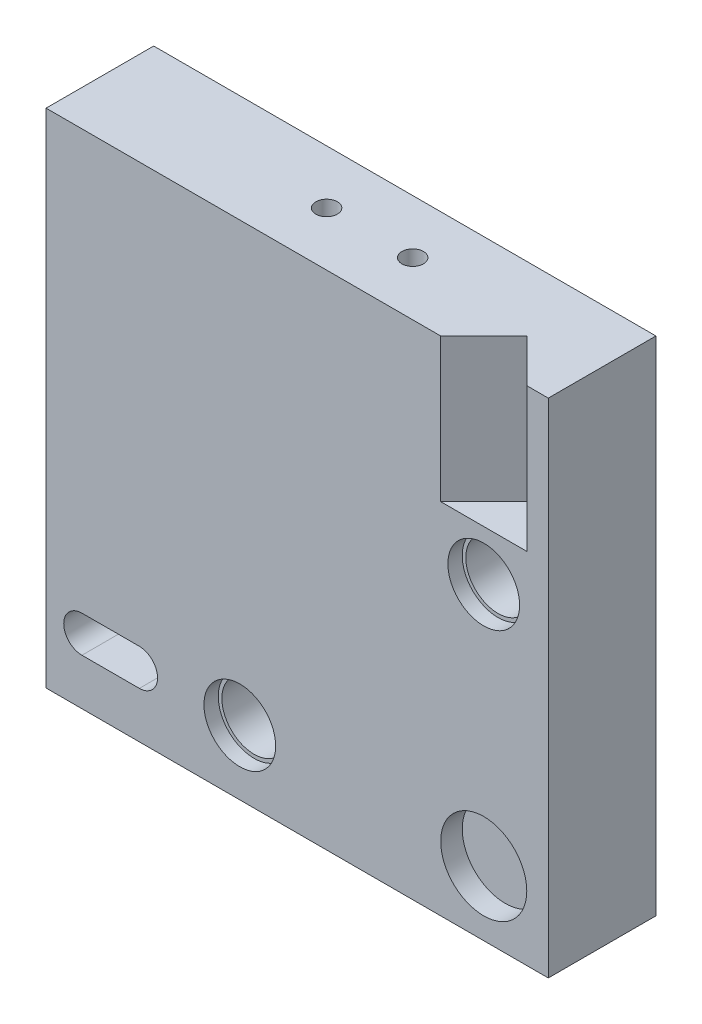
ISO-10303-21;
HEADER;
FILE_DESCRIPTION(('STEP AP214'),'2;1');
FILE_NAME('part.step','',(''),(''),'','','');
FILE_SCHEMA(('AUTOMOTIVE_DESIGN { 1 0 10303 214 1 1 1 1 }'));
ENDSEC;
DATA;
#1=APPLICATION_CONTEXT('core data for automotive mechanical design processes');
#2=APPLICATION_PROTOCOL_DEFINITION('international standard','automotive_design',2000,#1);
#3=PRODUCT_CONTEXT('',#1,'mechanical');
#4=PRODUCT('Part','Part','',(#3));
#5=PRODUCT_RELATED_PRODUCT_CATEGORY('part','',(#4));
#6=PRODUCT_DEFINITION_FORMATION('','',#4);
#7=PRODUCT_DEFINITION_CONTEXT('part definition',#1,'design');
#8=PRODUCT_DEFINITION('design','',#6,#7);
#9=PRODUCT_DEFINITION_SHAPE('','',#8);
#10=(LENGTH_UNIT() NAMED_UNIT(*) SI_UNIT(.MILLI.,.METRE.));
#11=(NAMED_UNIT(*) PLANE_ANGLE_UNIT() SI_UNIT($,.RADIAN.));
#12=(NAMED_UNIT(*) SI_UNIT($,.STERADIAN.) SOLID_ANGLE_UNIT());
#13=UNCERTAINTY_MEASURE_WITH_UNIT(LENGTH_MEASURE(1.E-05),#10,'distance_accuracy_value','');
#14=(GEOMETRIC_REPRESENTATION_CONTEXT(3) GLOBAL_UNCERTAINTY_ASSIGNED_CONTEXT((#13)) GLOBAL_UNIT_ASSIGNED_CONTEXT((#10,
#11,#12)) REPRESENTATION_CONTEXT('',''));
#15=CARTESIAN_POINT('',(0.,0.,0.));
#16=DIRECTION('',(0.,0.,1.));
#17=DIRECTION('',(1.,0.,0.));
#18=AXIS2_PLACEMENT_3D('',#15,#16,#17);
#19=CARTESIAN_POINT('',(-17.7337400728311,13.9900899837107,7.5));
#20=DIRECTION('',(1.,0.,0.));
#21=DIRECTION('',(0.,1.,0.));
#22=AXIS2_PLACEMENT_3D('',#19,#20,#21);
#23=PLANE('',#22);
#24=DIRECTION('',(0.,1.,0.));
#25=VECTOR('',#24,1.);
#26=CARTESIAN_POINT('',(-17.7337400728311,2.99008998371074,5.));
#27=LINE('',#26,#25);
#28=CARTESIAN_POINT('',(-17.7337400728311,-10.0099100162893,5.));
#29=VERTEX_POINT('',#28);
#30=CARTESIAN_POINT('',(-17.7337400728311,2.99008998371074,5.));
#31=VERTEX_POINT('',#30);
#32=EDGE_CURVE('E237',#29,#31,#27,.T.);
#33=ORIENTED_EDGE('',*,*,#32,.F.);
#34=DIRECTION('',(0.,0.,-1.));
#35=VECTOR('',#34,1.);
#36=CARTESIAN_POINT('',(-17.7337400728311,-10.0099100162893,5.));
#37=LINE('',#36,#35);
#38=CARTESIAN_POINT('',(-17.7337400728311,-10.0099100162893,0.));
#39=VERTEX_POINT('',#38);
#40=EDGE_CURVE('E257',#29,#39,#37,.T.);
#41=ORIENTED_EDGE('',*,*,#40,.T.);
#42=DIRECTION('',(0.,-1.,0.));
#43=VECTOR('',#42,1.);
#44=CARTESIAN_POINT('',(-17.7337400728311,13.9900899837107,0.));
#45=LINE('',#44,#43);
#46=CARTESIAN_POINT('',(-17.7337400728311,-21.0099100162893,0.));
#47=VERTEX_POINT('',#46);
#48=EDGE_CURVE('E260',#39,#47,#45,.T.);
#49=ORIENTED_EDGE('',*,*,#48,.T.);
#50=DIRECTION('',(0.,0.,-1.));
#51=VECTOR('',#50,1.);
#52=CARTESIAN_POINT('',(-17.7337400728311,-21.0099100162893,7.5));
#53=LINE('',#52,#51);
#54=CARTESIAN_POINT('',(-17.7337400728311,-21.0099100162893,7.5));
#55=VERTEX_POINT('',#54);
#56=EDGE_CURVE('E11',#55,#47,#53,.T.);
#57=ORIENTED_EDGE('',*,*,#56,.F.);
#58=DIRECTION('',(0.,-1.,0.));
#59=VECTOR('',#58,1.);
#60=CARTESIAN_POINT('',(-17.7337400728311,13.9900899837107,7.5));
#61=LINE('',#60,#59);
#62=CARTESIAN_POINT('',(-17.7337400728311,13.9900899837107,7.5));
#63=VERTEX_POINT('',#62);
#64=EDGE_CURVE('E266',#63,#55,#61,.T.);
#65=ORIENTED_EDGE('',*,*,#64,.F.);
#66=DIRECTION('',(0.,0.,-1.));
#67=VECTOR('',#66,1.);
#68=CARTESIAN_POINT('',(-17.7337400728311,13.9900899837107,7.5));
#69=LINE('',#68,#67);
#70=CARTESIAN_POINT('',(-17.7337400728311,13.9900899837107,0.));
#71=VERTEX_POINT('',#70);
#72=EDGE_CURVE('E278',#63,#71,#69,.T.);
#73=ORIENTED_EDGE('',*,*,#72,.T.);
#74=CARTESIAN_POINT('',(-17.7337400728311,2.99008998371073,0.));
#75=VERTEX_POINT('',#74);
#76=EDGE_CURVE('E279',#71,#75,#45,.T.);
#77=ORIENTED_EDGE('',*,*,#76,.T.);
#78=DIRECTION('',(0.,0.,-1.));
#79=VECTOR('',#78,1.);
#80=CARTESIAN_POINT('',(-17.7337400728311,2.99008998371074,5.));
#81=LINE('',#80,#79);
#82=EDGE_CURVE('E250',#31,#75,#81,.T.);
#83=ORIENTED_EDGE('',*,*,#82,.F.);
#84=EDGE_LOOP('',(#33,#41,#49,#57,#65,#73,#77,#83));
#85=FACE_BOUND('',#84,.T.);
#86=ADVANCED_FACE('F33',(#85),#23,.F.);
#87=CARTESIAN_POINT('',(-17.7337400728311,-21.0099100162893,7.5));
#88=DIRECTION('',(0.,1.,0.));
#89=DIRECTION('',(0.,0.,1.));
#90=AXIS2_PLACEMENT_3D('',#87,#88,#89);
#91=PLANE('',#90);
#92=DIRECTION('',(0.,0.,-1.));
#93=VECTOR('',#92,1.);
#94=CARTESIAN_POINT('',(17.2662599271689,-21.0099100162893,7.5));
#95=LINE('',#94,#93);
#96=CARTESIAN_POINT('',(17.2662599271689,-21.0099100162893,7.5));
#97=VERTEX_POINT('',#96);
#98=CARTESIAN_POINT('',(17.2662599271689,-21.0099100162893,0.));
#99=VERTEX_POINT('',#98);
#100=EDGE_CURVE('E40',#97,#99,#95,.T.);
#101=ORIENTED_EDGE('',*,*,#100,.F.);
#102=DIRECTION('',(1.,0.,0.));
#103=VECTOR('',#102,1.);
#104=CARTESIAN_POINT('',(-17.7337400728311,-21.0099100162893,7.5));
#105=LINE('',#104,#103);
#106=EDGE_CURVE('E269',#55,#97,#105,.T.);
#107=ORIENTED_EDGE('',*,*,#106,.F.);
#108=ORIENTED_EDGE('',*,*,#56,.T.);
#109=DIRECTION('',(1.,0.,0.));
#110=VECTOR('',#109,1.);
#111=CARTESIAN_POINT('',(-17.7337400728311,-21.0099100162893,0.));
#112=LINE('',#111,#110);
#113=EDGE_CURVE('E282',#47,#99,#112,.T.);
#114=ORIENTED_EDGE('',*,*,#113,.T.);
#115=EDGE_LOOP('',(#101,#107,#108,#114));
#116=FACE_BOUND('',#115,.T.);
#117=ADVANCED_FACE('F339',(#116),#91,.F.);
#118=CARTESIAN_POINT('',(17.2662599271689,13.9900899837107,7.5));
#119=DIRECTION('',(-1.,0.,0.));
#120=DIRECTION('',(0.,-1.,0.));
#121=AXIS2_PLACEMENT_3D('',#118,#119,#120);
#122=PLANE('',#121);
#123=DIRECTION('',(0.,1.,0.));
#124=VECTOR('',#123,1.);
#125=CARTESIAN_POINT('',(17.2662599271689,13.9900899837107,0.));
#126=LINE('',#125,#124);
#127=CARTESIAN_POINT('',(17.2662599271689,13.9900899837107,0.));
#128=VERTEX_POINT('',#127);
#129=EDGE_CURVE('E284',#99,#128,#126,.T.);
#130=ORIENTED_EDGE('',*,*,#129,.T.);
#131=DIRECTION('',(0.,0.,-1.));
#132=VECTOR('',#131,1.);
#133=CARTESIAN_POINT('',(17.2662599271689,13.9900899837107,7.5));
#134=LINE('',#133,#132);
#135=CARTESIAN_POINT('',(17.2662599271689,13.9900899837107,7.5));
#136=VERTEX_POINT('',#135);
#137=EDGE_CURVE('E289',#136,#128,#134,.T.);
#138=ORIENTED_EDGE('',*,*,#137,.F.);
#139=DIRECTION('',(0.,1.,0.));
#140=VECTOR('',#139,1.);
#141=CARTESIAN_POINT('',(17.2662599271689,13.9900899837107,7.5));
#142=LINE('',#141,#140);
#143=EDGE_CURVE('E272',#97,#136,#142,.T.);
#144=ORIENTED_EDGE('',*,*,#143,.F.);
#145=ORIENTED_EDGE('',*,*,#100,.T.);
#146=EDGE_LOOP('',(#130,#138,#144,#145));
#147=FACE_BOUND('',#146,.T.);
#148=ADVANCED_FACE('F296',(#147),#122,.F.);
#149=CARTESIAN_POINT('',(-17.7337400728311,13.9900899837107,7.5));
#150=DIRECTION('',(0.,-1.,0.));
#151=DIRECTION('',(0.,0.,-1.));
#152=AXIS2_PLACEMENT_3D('',#149,#150,#151);
#153=PLANE('',#152);
#154=CARTESIAN_POINT('',(-1.9337400728311,13.9900899837107,3.75));
#155=DIRECTION('',(0.,1.,0.));
#156=DIRECTION('',(0.,0.,1.));
#157=AXIS2_PLACEMENT_3D('',#154,#155,#156);
#158=CIRCLE('',#157,0.75);
#159=CARTESIAN_POINT('',(-1.9337400728311,13.9900899837107,4.5));
#160=VERTEX_POINT('',#159);
#161=EDGE_CURVE('E222',#160,#160,#158,.T.);
#162=ORIENTED_EDGE('',*,*,#161,.F.);
#163=EDGE_LOOP('',(#162));
#164=FACE_BOUND('',#163,.T.);
#165=CARTESIAN_POINT('',(4.0662599271689,13.9900899837107,3.75));
#166=DIRECTION('',(0.,1.,0.));
#167=DIRECTION('',(0.,0.,1.));
#168=AXIS2_PLACEMENT_3D('',#165,#166,#167);
#169=CIRCLE('',#168,0.75);
#170=CARTESIAN_POINT('',(4.0662599271689,13.9900899837107,4.5));
#171=VERTEX_POINT('',#170);
#172=EDGE_CURVE('E228',#171,#171,#169,.T.);
#173=ORIENTED_EDGE('',*,*,#172,.F.);
#174=EDGE_LOOP('',(#173));
#175=FACE_BOUND('',#174,.T.);
#176=DIRECTION('',(-1.,0.,0.));
#177=VECTOR('',#176,1.);
#178=CARTESIAN_POINT('',(-17.7337400728311,13.9900899837107,7.5));
#179=LINE('',#178,#177);
#180=CARTESIAN_POINT('',(9.76625992716889,13.9900899837107,7.5));
#181=VERTEX_POINT('',#180);
#182=EDGE_CURVE('E274',#181,#63,#179,.T.);
#183=ORIENTED_EDGE('',*,*,#182,.F.);
#184=DIRECTION('',(-0.707106781186549,0.,0.707106781186546));
#185=VECTOR('',#184,1.);
#186=CARTESIAN_POINT('',(9.76625992716889,13.9900899837107,7.5));
#187=LINE('',#186,#185);
#188=CARTESIAN_POINT('',(12.7662599271689,13.9900899837107,4.5));
#189=VERTEX_POINT('',#188);
#190=EDGE_CURVE('E187',#189,#181,#187,.T.);
#191=ORIENTED_EDGE('',*,*,#190,.F.);
#192=DIRECTION('',(-0.707106781186546,0.,-0.707106781186549));
#193=VECTOR('',#192,1.);
#194=CARTESIAN_POINT('',(12.7662599271689,13.9900899837107,4.5));
#195=LINE('',#194,#193);
#196=CARTESIAN_POINT('',(15.7662599271689,13.9900899837107,7.5));
#197=VERTEX_POINT('',#196);
#198=EDGE_CURVE('E180',#197,#189,#195,.T.);
#199=ORIENTED_EDGE('',*,*,#198,.F.);
#200=EDGE_CURVE('E275',#136,#197,#179,.T.);
#201=ORIENTED_EDGE('',*,*,#200,.F.);
#202=ORIENTED_EDGE('',*,*,#137,.T.);
#203=DIRECTION('',(-1.,0.,0.));
#204=VECTOR('',#203,1.);
#205=CARTESIAN_POINT('',(-17.7337400728311,13.9900899837107,0.));
#206=LINE('',#205,#204);
#207=EDGE_CURVE('E270',#128,#71,#206,.T.);
#208=ORIENTED_EDGE('',*,*,#207,.T.);
#209=ORIENTED_EDGE('',*,*,#72,.F.);
#210=EDGE_LOOP('',(#183,#191,#199,#201,#202,#208,#209));
#211=FACE_BOUND('',#210,.T.);
#212=ADVANCED_FACE('F309',(#164,#175,#211),#153,.F.);
#213=CARTESIAN_POINT('',(0.,0.,7.5));
#214=DIRECTION('',(0.,0.,1.));
#215=DIRECTION('',(1.,0.,0.));
#216=AXIS2_PLACEMENT_3D('',#213,#214,#215);
#217=PLANE('',#216);
#218=CARTESIAN_POINT('',(12.7662599271689,-16.5099100162893,7.5));
#219=DIRECTION('',(0.,0.,1.));
#220=DIRECTION('',(1.,0.,0.));
#221=AXIS2_PLACEMENT_3D('',#218,#219,#220);
#222=CIRCLE('',#221,3.);
#223=CARTESIAN_POINT('',(15.7662599271689,-16.5099100162893,7.5));
#224=VERTEX_POINT('',#223);
#225=EDGE_CURVE('E167',#224,#224,#222,.T.);
#226=ORIENTED_EDGE('',*,*,#225,.F.);
#227=EDGE_LOOP('',(#226));
#228=FACE_BOUND('',#227,.T.);
#229=ORIENTED_EDGE('',*,*,#106,.T.);
#230=ORIENTED_EDGE('',*,*,#143,.T.);
#231=ORIENTED_EDGE('',*,*,#200,.T.);
#232=DIRECTION('',(0.,1.,0.));
#233=VECTOR('',#232,1.);
#234=CARTESIAN_POINT('',(15.7662599271689,3.99008998371073,7.5));
#235=LINE('',#234,#233);
#236=CARTESIAN_POINT('',(15.7662599271689,3.99008998371073,7.5));
#237=VERTEX_POINT('',#236);
#238=EDGE_CURVE('E190',#237,#197,#235,.T.);
#239=ORIENTED_EDGE('',*,*,#238,.F.);
#240=DIRECTION('',(1.,0.,0.));
#241=VECTOR('',#240,1.);
#242=CARTESIAN_POINT('',(9.76625992716889,3.99008998371073,7.5));
#243=LINE('',#242,#241);
#244=CARTESIAN_POINT('',(9.76625992716889,3.99008998371073,7.5));
#245=VERTEX_POINT('',#244);
#246=EDGE_CURVE('E184',#245,#237,#243,.T.);
#247=ORIENTED_EDGE('',*,*,#246,.F.);
#248=DIRECTION('',(0.,1.,0.));
#249=VECTOR('',#248,1.);
#250=CARTESIAN_POINT('',(9.76625992716889,3.99008998371073,7.5));
#251=LINE('',#250,#249);
#252=EDGE_CURVE('E194',#245,#181,#251,.T.);
#253=ORIENTED_EDGE('',*,*,#252,.T.);
#254=ORIENTED_EDGE('',*,*,#182,.T.);
#255=ORIENTED_EDGE('',*,*,#64,.T.);
#256=EDGE_LOOP('',(#229,#230,#231,#239,#247,#253,#254,#255));
#257=FACE_BOUND('',#256,.T.);
#258=CARTESIAN_POINT('',(-15.2337400728311,-16.5099100162893,7.5));
#259=DIRECTION('',(0.,0.,1.));
#260=DIRECTION('',(1.,0.,0.));
#261=AXIS2_PLACEMENT_3D('',#258,#259,#260);
#262=CIRCLE('',#261,1.27);
#263=CARTESIAN_POINT('',(-15.2337400728311,-15.2399100162893,7.5));
#264=VERTEX_POINT('',#263);
#265=CARTESIAN_POINT('',(-15.2337400728311,-17.7799100162893,7.5));
#266=VERTEX_POINT('',#265);
#267=EDGE_CURVE('E47',#264,#266,#262,.T.);
#268=ORIENTED_EDGE('',*,*,#267,.F.);
#269=DIRECTION('',(-1.,0.,0.));
#270=VECTOR('',#269,1.);
#271=CARTESIAN_POINT('',(-11.2337400728311,-15.2399100162893,7.5));
#272=LINE('',#271,#270);
#273=CARTESIAN_POINT('',(-11.2337400728311,-15.2399100162893,7.5));
#274=VERTEX_POINT('',#273);
#275=EDGE_CURVE('E161',#274,#264,#272,.T.);
#276=ORIENTED_EDGE('',*,*,#275,.F.);
#277=CARTESIAN_POINT('',(-11.2337400728311,-16.5099100162893,7.5));
#278=DIRECTION('',(0.,0.,1.));
#279=DIRECTION('',(-1.,0.,0.));
#280=AXIS2_PLACEMENT_3D('',#277,#278,#279);
#281=CIRCLE('',#280,1.27);
#282=CARTESIAN_POINT('',(-11.2337400728311,-17.7799100162893,7.5));
#283=VERTEX_POINT('',#282);
#284=EDGE_CURVE('E164',#283,#274,#281,.T.);
#285=ORIENTED_EDGE('',*,*,#284,.F.);
#286=DIRECTION('',(1.,0.,0.));
#287=VECTOR('',#286,1.);
#288=CARTESIAN_POINT('',(-11.2337400728311,-17.7799100162893,7.5));
#289=LINE('',#288,#287);
#290=EDGE_CURVE('E173',#266,#283,#289,.T.);
#291=ORIENTED_EDGE('',*,*,#290,.F.);
#292=EDGE_LOOP('',(#268,#276,#285,#291));
#293=FACE_BOUND('',#292,.T.);
#294=CARTESIAN_POINT('',(-4.23374007283109,-16.5099100162893,7.5));
#295=DIRECTION('',(0.,0.,1.));
#296=DIRECTION('',(1.,0.,0.));
#297=AXIS2_PLACEMENT_3D('',#294,#295,#296);
#298=CIRCLE('',#297,2.5);
#299=CARTESIAN_POINT('',(-1.73374007283109,-16.5099100162893,7.5));
#300=VERTEX_POINT('',#299);
#301=EDGE_CURVE('E210',#300,#300,#298,.T.);
#302=ORIENTED_EDGE('',*,*,#301,.F.);
#303=EDGE_LOOP('',(#302));
#304=FACE_BOUND('',#303,.T.);
#305=CARTESIAN_POINT('',(12.7662599271689,0.49008998371073,7.5));
#306=DIRECTION('',(0.,0.,1.));
#307=DIRECTION('',(1.,0.,0.));
#308=AXIS2_PLACEMENT_3D('',#305,#306,#307);
#309=CIRCLE('',#308,2.5);
#310=CARTESIAN_POINT('',(15.2662599271689,0.49008998371073,7.5));
#311=VERTEX_POINT('',#310);
#312=EDGE_CURVE('E216',#311,#311,#309,.T.);
#313=ORIENTED_EDGE('',*,*,#312,.F.);
#314=EDGE_LOOP('',(#313));
#315=FACE_BOUND('',#314,.T.);
#316=ADVANCED_FACE('F317',(#228,#257,#293,#304,#315),#217,.T.);
#317=CARTESIAN_POINT('',(0.,0.,0.));
#318=DIRECTION('',(0.,0.,1.));
#319=DIRECTION('',(1.,0.,0.));
#320=AXIS2_PLACEMENT_3D('',#317,#318,#319);
#321=PLANE('',#320);
#322=ORIENTED_EDGE('',*,*,#48,.F.);
#323=DIRECTION('',(-1.,0.,0.));
#324=VECTOR('',#323,1.);
#325=CARTESIAN_POINT('',(6.2662599271689,-10.0099100162893,0.));
#326=LINE('',#325,#324);
#327=CARTESIAN_POINT('',(6.2662599271689,-10.0099100162893,0.));
#328=VERTEX_POINT('',#327);
#329=EDGE_CURVE('E241',#328,#39,#326,.T.);
#330=ORIENTED_EDGE('',*,*,#329,.F.);
#331=DIRECTION('',(0.,-1.,0.));
#332=VECTOR('',#331,1.);
#333=CARTESIAN_POINT('',(6.2662599271689,2.99008998371073,0.));
#334=LINE('',#333,#332);
#335=CARTESIAN_POINT('',(6.2662599271689,2.99008998371073,0.));
#336=VERTEX_POINT('',#335);
#337=EDGE_CURVE('E253',#336,#328,#334,.T.);
#338=ORIENTED_EDGE('',*,*,#337,.F.);
#339=DIRECTION('',(1.,0.,0.));
#340=VECTOR('',#339,1.);
#341=CARTESIAN_POINT('',(-17.7337400728311,2.99008998371074,0.));
#342=LINE('',#341,#340);
#343=EDGE_CURVE('E234',#75,#336,#342,.T.);
#344=ORIENTED_EDGE('',*,*,#343,.F.);
#345=ORIENTED_EDGE('',*,*,#76,.F.);
#346=ORIENTED_EDGE('',*,*,#207,.F.);
#347=ORIENTED_EDGE('',*,*,#129,.F.);
#348=ORIENTED_EDGE('',*,*,#113,.F.);
#349=EDGE_LOOP('',(#322,#330,#338,#344,#345,#346,#347,#348));
#350=FACE_BOUND('',#349,.T.);
#351=ADVANCED_FACE('F303',(#350),#321,.F.);
#352=CARTESIAN_POINT('',(6.2662599271689,-10.0099100162893,5.));
#353=DIRECTION('',(0.,-1.,0.));
#354=DIRECTION('',(1.,0.,0.));
#355=AXIS2_PLACEMENT_3D('',#352,#353,#354);
#356=PLANE('',#355);
#357=ORIENTED_EDGE('',*,*,#329,.T.);
#358=ORIENTED_EDGE('',*,*,#40,.F.);
#359=DIRECTION('',(-1.,0.,0.));
#360=VECTOR('',#359,1.);
#361=CARTESIAN_POINT('',(6.2662599271689,-10.0099100162893,5.));
#362=LINE('',#361,#360);
#363=CARTESIAN_POINT('',(6.2662599271689,-10.0099100162893,5.));
#364=VERTEX_POINT('',#363);
#365=EDGE_CURVE('E247',#364,#29,#362,.T.);
#366=ORIENTED_EDGE('',*,*,#365,.F.);
#367=DIRECTION('',(0.,0.,-1.));
#368=VECTOR('',#367,1.);
#369=CARTESIAN_POINT('',(6.2662599271689,-10.0099100162893,5.));
#370=LINE('',#369,#368);
#371=EDGE_CURVE('E261',#364,#328,#370,.T.);
#372=ORIENTED_EDGE('',*,*,#371,.T.);
#373=EDGE_LOOP('',(#357,#358,#366,#372));
#374=FACE_BOUND('',#373,.T.);
#375=ADVANCED_FACE('F353',(#374),#356,.F.);
#376=CARTESIAN_POINT('',(6.2662599271689,2.99008998371073,5.));
#377=DIRECTION('',(1.,0.,0.));
#378=DIRECTION('',(0.,1.,0.));
#379=AXIS2_PLACEMENT_3D('',#376,#377,#378);
#380=PLANE('',#379);
#381=ORIENTED_EDGE('',*,*,#337,.T.);
#382=ORIENTED_EDGE('',*,*,#371,.F.);
#383=DIRECTION('',(0.,-1.,0.));
#384=VECTOR('',#383,1.);
#385=CARTESIAN_POINT('',(6.2662599271689,2.99008998371073,5.));
#386=LINE('',#385,#384);
#387=CARTESIAN_POINT('',(6.2662599271689,2.99008998371073,5.));
#388=VERTEX_POINT('',#387);
#389=EDGE_CURVE('E244',#388,#364,#386,.T.);
#390=ORIENTED_EDGE('',*,*,#389,.F.);
#391=DIRECTION('',(0.,0.,-1.));
#392=VECTOR('',#391,1.);
#393=CARTESIAN_POINT('',(6.2662599271689,2.99008998371073,5.));
#394=LINE('',#393,#392);
#395=EDGE_CURVE('E263',#388,#336,#394,.T.);
#396=ORIENTED_EDGE('',*,*,#395,.T.);
#397=EDGE_LOOP('',(#381,#382,#390,#396));
#398=FACE_BOUND('',#397,.T.);
#399=ADVANCED_FACE('F361',(#398),#380,.F.);
#400=CARTESIAN_POINT('',(-17.7337400728311,2.99008998371074,5.));
#401=DIRECTION('',(0.,1.,0.));
#402=DIRECTION('',(-1.,0.,0.));
#403=AXIS2_PLACEMENT_3D('',#400,#401,#402);
#404=PLANE('',#403);
#405=ORIENTED_EDGE('',*,*,#343,.T.);
#406=ORIENTED_EDGE('',*,*,#395,.F.);
#407=DIRECTION('',(1.,0.,0.));
#408=VECTOR('',#407,1.);
#409=CARTESIAN_POINT('',(-17.7337400728311,2.99008998371074,5.));
#410=LINE('',#409,#408);
#411=EDGE_CURVE('E240',#31,#388,#410,.T.);
#412=ORIENTED_EDGE('',*,*,#411,.F.);
#413=ORIENTED_EDGE('',*,*,#82,.T.);
#414=EDGE_LOOP('',(#405,#406,#412,#413));
#415=FACE_BOUND('',#414,.T.);
#416=ADVANCED_FACE('F357',(#415),#404,.F.);
#417=CARTESIAN_POINT('',(0.,0.,5.));
#418=DIRECTION('',(0.,0.,-1.));
#419=DIRECTION('',(-1.,0.,0.));
#420=AXIS2_PLACEMENT_3D('',#417,#418,#419);
#421=PLANE('',#420);
#422=ORIENTED_EDGE('',*,*,#32,.T.);
#423=ORIENTED_EDGE('',*,*,#411,.T.);
#424=ORIENTED_EDGE('',*,*,#389,.T.);
#425=ORIENTED_EDGE('',*,*,#365,.T.);
#426=EDGE_LOOP('',(#422,#423,#424,#425));
#427=FACE_BOUND('',#426,.T.);
#428=ADVANCED_FACE('F360',(#427),#421,.T.);
#429=CARTESIAN_POINT('',(4.0662599271689,6.99008998371074,3.75));
#430=DIRECTION('',(0.,1.,0.));
#431=DIRECTION('',(0.,0.,1.));
#432=AXIS2_PLACEMENT_3D('',#429,#430,#431);
#433=CYLINDRICAL_SURFACE('',#432,0.75);
#434=CARTESIAN_POINT('',(4.0662599271689,6.99008998371074,3.75));
#435=DIRECTION('',(0.,1.,0.));
#436=DIRECTION('',(0.,0.,1.));
#437=AXIS2_PLACEMENT_3D('',#434,#435,#436);
#438=CIRCLE('',#437,0.75);
#439=CARTESIAN_POINT('',(4.0662599271689,6.99008998371074,4.5));
#440=VERTEX_POINT('',#439);
#441=EDGE_CURVE('E231',#440,#440,#438,.T.);
#442=ORIENTED_EDGE('',*,*,#441,.F.);
#443=EDGE_LOOP('',(#442));
#444=FACE_BOUND('',#443,.T.);
#445=ORIENTED_EDGE('',*,*,#172,.T.);
#446=EDGE_LOOP('',(#445));
#447=FACE_BOUND('',#446,.T.);
#448=ADVANCED_FACE('F371',(#444,#447),#433,.F.);
#449=CARTESIAN_POINT('',(4.0662599271689,6.99008998371074,3.75));
#450=DIRECTION('',(0.,1.,0.));
#451=DIRECTION('',(0.,0.,1.));
#452=AXIS2_PLACEMENT_3D('',#449,#450,#451);
#453=PLANE('',#452);
#454=ORIENTED_EDGE('',*,*,#441,.T.);
#455=EDGE_LOOP('',(#454));
#456=FACE_BOUND('',#455,.T.);
#457=ADVANCED_FACE('F375',(#456),#453,.T.);
#458=CARTESIAN_POINT('',(-1.9337400728311,6.99008998371074,3.75));
#459=DIRECTION('',(0.,1.,0.));
#460=DIRECTION('',(0.,0.,1.));
#461=AXIS2_PLACEMENT_3D('',#458,#459,#460);
#462=CYLINDRICAL_SURFACE('',#461,0.75);
#463=CARTESIAN_POINT('',(-1.9337400728311,6.99008998371074,3.75));
#464=DIRECTION('',(0.,1.,0.));
#465=DIRECTION('',(0.,0.,1.));
#466=AXIS2_PLACEMENT_3D('',#463,#464,#465);
#467=CIRCLE('',#466,0.75);
#468=CARTESIAN_POINT('',(-1.9337400728311,6.99008998371074,4.5));
#469=VERTEX_POINT('',#468);
#470=EDGE_CURVE('E225',#469,#469,#467,.T.);
#471=ORIENTED_EDGE('',*,*,#470,.F.);
#472=EDGE_LOOP('',(#471));
#473=FACE_BOUND('',#472,.T.);
#474=ORIENTED_EDGE('',*,*,#161,.T.);
#475=EDGE_LOOP('',(#474));
#476=FACE_BOUND('',#475,.T.);
#477=ADVANCED_FACE('F379',(#473,#476),#462,.F.);
#478=CARTESIAN_POINT('',(-1.9337400728311,6.99008998371074,3.75));
#479=DIRECTION('',(0.,1.,0.));
#480=DIRECTION('',(0.,0.,1.));
#481=AXIS2_PLACEMENT_3D('',#478,#479,#480);
#482=PLANE('',#481);
#483=ORIENTED_EDGE('',*,*,#470,.T.);
#484=EDGE_LOOP('',(#483));
#485=FACE_BOUND('',#484,.T.);
#486=ADVANCED_FACE('F383',(#485),#482,.T.);
#487=CARTESIAN_POINT('',(12.7662599271689,0.49008998371073,6.5));
#488=DIRECTION('',(0.,0.,1.));
#489=DIRECTION('',(1.,0.,0.));
#490=AXIS2_PLACEMENT_3D('',#487,#488,#489);
#491=CYLINDRICAL_SURFACE('',#490,2.5);
#492=CARTESIAN_POINT('',(12.7662599271689,0.49008998371073,6.5));
#493=DIRECTION('',(0.,0.,1.));
#494=DIRECTION('',(1.,0.,0.));
#495=AXIS2_PLACEMENT_3D('',#492,#493,#494);
#496=CIRCLE('',#495,2.5);
#497=CARTESIAN_POINT('',(15.2662599271689,0.49008998371073,6.5));
#498=VERTEX_POINT('',#497);
#499=EDGE_CURVE('E219',#498,#498,#496,.T.);
#500=ORIENTED_EDGE('',*,*,#499,.F.);
#501=EDGE_LOOP('',(#500));
#502=FACE_BOUND('',#501,.T.);
#503=ORIENTED_EDGE('',*,*,#312,.T.);
#504=EDGE_LOOP('',(#503));
#505=FACE_BOUND('',#504,.T.);
#506=ADVANCED_FACE('F387',(#502,#505),#491,.F.);
#507=CARTESIAN_POINT('',(12.7662599271689,0.49008998371073,6.5));
#508=DIRECTION('',(0.,0.,1.));
#509=DIRECTION('',(1.,0.,0.));
#510=AXIS2_PLACEMENT_3D('',#507,#508,#509);
#511=PLANE('',#510);
#512=CARTESIAN_POINT('',(12.7662599271689,0.49008998371073,6.5));
#513=DIRECTION('',(0.,0.,1.));
#514=DIRECTION('',(1.,0.,0.));
#515=AXIS2_PLACEMENT_3D('',#512,#513,#514);
#516=CIRCLE('',#515,2.25);
#517=CARTESIAN_POINT('',(15.0162599271689,0.49008998371073,6.5));
#518=VERTEX_POINT('',#517);
#519=EDGE_CURVE('E197',#518,#518,#516,.T.);
#520=ORIENTED_EDGE('',*,*,#519,.F.);
#521=EDGE_LOOP('',(#520));
#522=FACE_BOUND('',#521,.T.);
#523=ORIENTED_EDGE('',*,*,#499,.T.);
#524=EDGE_LOOP('',(#523));
#525=FACE_BOUND('',#524,.T.);
#526=ADVANCED_FACE('F391',(#522,#525),#511,.T.);
#527=CARTESIAN_POINT('',(-4.23374007283109,-16.5099100162893,6.5));
#528=DIRECTION('',(0.,0.,1.));
#529=DIRECTION('',(1.,0.,0.));
#530=AXIS2_PLACEMENT_3D('',#527,#528,#529);
#531=CYLINDRICAL_SURFACE('',#530,2.5);
#532=CARTESIAN_POINT('',(-4.23374007283109,-16.5099100162893,6.5));
#533=DIRECTION('',(0.,0.,1.));
#534=DIRECTION('',(1.,0.,0.));
#535=AXIS2_PLACEMENT_3D('',#532,#533,#534);
#536=CIRCLE('',#535,2.5);
#537=CARTESIAN_POINT('',(-1.73374007283109,-16.5099100162893,6.5));
#538=VERTEX_POINT('',#537);
#539=EDGE_CURVE('E213',#538,#538,#536,.T.);
#540=ORIENTED_EDGE('',*,*,#539,.F.);
#541=EDGE_LOOP('',(#540));
#542=FACE_BOUND('',#541,.T.);
#543=ORIENTED_EDGE('',*,*,#301,.T.);
#544=EDGE_LOOP('',(#543));
#545=FACE_BOUND('',#544,.T.);
#546=ADVANCED_FACE('F395',(#542,#545),#531,.F.);
#547=CARTESIAN_POINT('',(-4.23374007283109,-16.5099100162893,6.5));
#548=DIRECTION('',(0.,0.,1.));
#549=DIRECTION('',(1.,0.,0.));
#550=AXIS2_PLACEMENT_3D('',#547,#548,#549);
#551=PLANE('',#550);
#552=CARTESIAN_POINT('',(-4.23374007283109,-16.5099100162893,6.5));
#553=DIRECTION('',(0.,0.,1.));
#554=DIRECTION('',(1.,0.,0.));
#555=AXIS2_PLACEMENT_3D('',#552,#553,#554);
#556=CIRCLE('',#555,2.25);
#557=CARTESIAN_POINT('',(-1.9837400728311,-16.5099100162893,6.5));
#558=VERTEX_POINT('',#557);
#559=EDGE_CURVE('E204',#558,#558,#556,.T.);
#560=ORIENTED_EDGE('',*,*,#559,.F.);
#561=EDGE_LOOP('',(#560));
#562=FACE_BOUND('',#561,.T.);
#563=ORIENTED_EDGE('',*,*,#539,.T.);
#564=EDGE_LOOP('',(#563));
#565=FACE_BOUND('',#564,.T.);
#566=ADVANCED_FACE('F399',(#562,#565),#551,.T.);
#567=CARTESIAN_POINT('',(-4.23374007283109,-16.5099100162893,1.5));
#568=DIRECTION('',(0.,0.,1.));
#569=DIRECTION('',(1.,0.,0.));
#570=AXIS2_PLACEMENT_3D('',#567,#568,#569);
#571=CYLINDRICAL_SURFACE('',#570,2.25);
#572=CARTESIAN_POINT('',(-4.23374007283109,-16.5099100162893,1.5));
#573=DIRECTION('',(0.,0.,1.));
#574=DIRECTION('',(1.,0.,0.));
#575=AXIS2_PLACEMENT_3D('',#572,#573,#574);
#576=CIRCLE('',#575,2.25);
#577=CARTESIAN_POINT('',(-1.9837400728311,-16.5099100162893,1.5));
#578=VERTEX_POINT('',#577);
#579=EDGE_CURVE('E207',#578,#578,#576,.T.);
#580=ORIENTED_EDGE('',*,*,#579,.F.);
#581=EDGE_LOOP('',(#580));
#582=FACE_BOUND('',#581,.T.);
#583=ORIENTED_EDGE('',*,*,#559,.T.);
#584=EDGE_LOOP('',(#583));
#585=FACE_BOUND('',#584,.T.);
#586=ADVANCED_FACE('F403',(#582,#585),#571,.F.);
#587=CARTESIAN_POINT('',(-4.23374007283109,-16.5099100162893,1.5));
#588=DIRECTION('',(0.,0.,1.));
#589=DIRECTION('',(1.,0.,0.));
#590=AXIS2_PLACEMENT_3D('',#587,#588,#589);
#591=PLANE('',#590);
#592=ORIENTED_EDGE('',*,*,#579,.T.);
#593=EDGE_LOOP('',(#592));
#594=FACE_BOUND('',#593,.T.);
#595=ADVANCED_FACE('F407',(#594),#591,.T.);
#596=CARTESIAN_POINT('',(12.7662599271689,0.49008998371073,1.5));
#597=DIRECTION('',(0.,0.,1.));
#598=DIRECTION('',(1.,0.,0.));
#599=AXIS2_PLACEMENT_3D('',#596,#597,#598);
#600=CYLINDRICAL_SURFACE('',#599,2.25);
#601=CARTESIAN_POINT('',(12.7662599271689,0.49008998371073,1.5));
#602=DIRECTION('',(0.,0.,1.));
#603=DIRECTION('',(1.,0.,0.));
#604=AXIS2_PLACEMENT_3D('',#601,#602,#603);
#605=CIRCLE('',#604,2.25);
#606=CARTESIAN_POINT('',(15.0162599271689,0.49008998371073,1.5));
#607=VERTEX_POINT('',#606);
#608=EDGE_CURVE('E201',#607,#607,#605,.T.);
#609=ORIENTED_EDGE('',*,*,#608,.F.);
#610=EDGE_LOOP('',(#609));
#611=FACE_BOUND('',#610,.T.);
#612=ORIENTED_EDGE('',*,*,#519,.T.);
#613=EDGE_LOOP('',(#612));
#614=FACE_BOUND('',#613,.T.);
#615=ADVANCED_FACE('F411',(#611,#614),#600,.F.);
#616=CARTESIAN_POINT('',(12.7662599271689,0.49008998371073,1.5));
#617=DIRECTION('',(0.,0.,1.));
#618=DIRECTION('',(1.,0.,0.));
#619=AXIS2_PLACEMENT_3D('',#616,#617,#618);
#620=PLANE('',#619);
#621=ORIENTED_EDGE('',*,*,#608,.T.);
#622=EDGE_LOOP('',(#621));
#623=FACE_BOUND('',#622,.T.);
#624=ADVANCED_FACE('F415',(#623),#620,.T.);
#625=CARTESIAN_POINT('',(9.76625992716889,3.99008998371073,7.5));
#626=DIRECTION('',(-0.707106781186546,0.,-0.707106781186549));
#627=DIRECTION('',(-0.707106781186549,0.,0.707106781186546));
#628=AXIS2_PLACEMENT_3D('',#625,#626,#627);
#629=PLANE('',#628);
#630=ORIENTED_EDGE('',*,*,#190,.T.);
#631=ORIENTED_EDGE('',*,*,#252,.F.);
#632=DIRECTION('',(-0.707106781186549,0.,0.707106781186546));
#633=VECTOR('',#632,1.);
#634=CARTESIAN_POINT('',(9.76625992716889,3.99008998371073,7.5));
#635=LINE('',#634,#633);
#636=CARTESIAN_POINT('',(12.7662599271689,3.99008998371073,4.5));
#637=VERTEX_POINT('',#636);
#638=EDGE_CURVE('E55',#637,#245,#635,.T.);
#639=ORIENTED_EDGE('',*,*,#638,.F.);
#640=DIRECTION('',(0.,1.,0.));
#641=VECTOR('',#640,1.);
#642=CARTESIAN_POINT('',(12.7662599271689,3.99008998371073,4.5));
#643=LINE('',#642,#641);
#644=EDGE_CURVE('E198',#637,#189,#643,.T.);
#645=ORIENTED_EDGE('',*,*,#644,.T.);
#646=EDGE_LOOP('',(#630,#631,#639,#645));
#647=FACE_BOUND('',#646,.T.);
#648=ADVANCED_FACE('F323',(#647),#629,.F.);
#649=CARTESIAN_POINT('',(12.7662599271689,3.99008998371073,4.5));
#650=DIRECTION('',(0.707106781186549,0.,-0.707106781186546));
#651=DIRECTION('',(-0.707106781186546,0.,-0.707106781186549));
#652=AXIS2_PLACEMENT_3D('',#649,#650,#651);
#653=PLANE('',#652);
#654=ORIENTED_EDGE('',*,*,#198,.T.);
#655=ORIENTED_EDGE('',*,*,#644,.F.);
#656=DIRECTION('',(-0.707106781186546,0.,-0.707106781186549));
#657=VECTOR('',#656,1.);
#658=CARTESIAN_POINT('',(12.7662599271689,3.99008998371073,4.5));
#659=LINE('',#658,#657);
#660=EDGE_CURVE('E186',#237,#637,#659,.T.);
#661=ORIENTED_EDGE('',*,*,#660,.F.);
#662=ORIENTED_EDGE('',*,*,#238,.T.);
#663=EDGE_LOOP('',(#654,#655,#661,#662));
#664=FACE_BOUND('',#663,.T.);
#665=ADVANCED_FACE('F325',(#664),#653,.F.);
#666=CARTESIAN_POINT('',(0.,3.99008998371073,0.));
#667=DIRECTION('',(0.,-1.,0.));
#668=DIRECTION('',(0.,0.,-1.));
#669=AXIS2_PLACEMENT_3D('',#666,#667,#668);
#670=PLANE('',#669);
#671=ORIENTED_EDGE('',*,*,#246,.T.);
#672=ORIENTED_EDGE('',*,*,#660,.T.);
#673=ORIENTED_EDGE('',*,*,#638,.T.);
#674=EDGE_LOOP('',(#671,#672,#673));
#675=FACE_BOUND('',#674,.T.);
#676=ADVANCED_FACE('F327',(#675),#670,.F.);
#677=CARTESIAN_POINT('',(-15.2337400728311,-16.5099100162893,3.5));
#678=DIRECTION('',(0.,0.,1.));
#679=DIRECTION('',(1.,0.,0.));
#680=AXIS2_PLACEMENT_3D('',#677,#678,#679);
#681=CYLINDRICAL_SURFACE('',#680,1.27);
#682=ORIENTED_EDGE('',*,*,#267,.T.);
#683=DIRECTION('',(0.,0.,1.));
#684=VECTOR('',#683,1.);
#685=CARTESIAN_POINT('',(-15.2337400728311,-17.7799100162893,3.5));
#686=LINE('',#685,#684);
#687=CARTESIAN_POINT('',(-15.2337400728311,-17.7799100162893,3.5));
#688=VERTEX_POINT('',#687);
#689=EDGE_CURVE('E139',#688,#266,#686,.T.);
#690=ORIENTED_EDGE('',*,*,#689,.F.);
#691=CARTESIAN_POINT('',(-15.2337400728311,-16.5099100162893,3.5));
#692=DIRECTION('',(0.,0.,1.));
#693=DIRECTION('',(1.,0.,0.));
#694=AXIS2_PLACEMENT_3D('',#691,#692,#693);
#695=CIRCLE('',#694,1.27);
#696=CARTESIAN_POINT('',(-15.2337400728311,-15.2399100162893,3.5));
#697=VERTEX_POINT('',#696);
#698=EDGE_CURVE('E143',#697,#688,#695,.T.);
#699=ORIENTED_EDGE('',*,*,#698,.F.);
#700=DIRECTION('',(0.,0.,1.));
#701=VECTOR('',#700,1.);
#702=CARTESIAN_POINT('',(-15.2337400728311,-15.2399100162893,3.5));
#703=LINE('',#702,#701);
#704=EDGE_CURVE('E178',#697,#264,#703,.T.);
#705=ORIENTED_EDGE('',*,*,#704,.T.);
#706=EDGE_LOOP('',(#682,#690,#699,#705));
#707=FACE_BOUND('',#706,.T.);
#708=ADVANCED_FACE('F141',(#707),#681,.F.);
#709=CARTESIAN_POINT('',(-11.2337400728311,-15.2399100162893,3.5));
#710=DIRECTION('',(0.,1.,0.));
#711=DIRECTION('',(-1.,0.,0.));
#712=AXIS2_PLACEMENT_3D('',#709,#710,#711);
#713=PLANE('',#712);
#714=ORIENTED_EDGE('',*,*,#275,.T.);
#715=ORIENTED_EDGE('',*,*,#704,.F.);
#716=DIRECTION('',(-1.,0.,0.));
#717=VECTOR('',#716,1.);
#718=CARTESIAN_POINT('',(-11.2337400728311,-15.2399100162893,3.5));
#719=LINE('',#718,#717);
#720=CARTESIAN_POINT('',(-11.2337400728311,-15.2399100162893,3.5));
#721=VERTEX_POINT('',#720);
#722=EDGE_CURVE('E149',#721,#697,#719,.T.);
#723=ORIENTED_EDGE('',*,*,#722,.F.);
#724=DIRECTION('',(0.,0.,1.));
#725=VECTOR('',#724,1.);
#726=CARTESIAN_POINT('',(-11.2337400728311,-15.2399100162893,3.5));
#727=LINE('',#726,#725);
#728=EDGE_CURVE('E181',#721,#274,#727,.T.);
#729=ORIENTED_EDGE('',*,*,#728,.T.);
#730=EDGE_LOOP('',(#714,#715,#723,#729));
#731=FACE_BOUND('',#730,.T.);
#732=ADVANCED_FACE('F334',(#731),#713,.F.);
#733=CARTESIAN_POINT('',(-11.2337400728311,-16.5099100162893,3.5));
#734=DIRECTION('',(0.,0.,1.));
#735=DIRECTION('',(1.,0.,0.));
#736=AXIS2_PLACEMENT_3D('',#733,#734,#735);
#737=CYLINDRICAL_SURFACE('',#736,1.27);
#738=ORIENTED_EDGE('',*,*,#284,.T.);
#739=ORIENTED_EDGE('',*,*,#728,.F.);
#740=CARTESIAN_POINT('',(-11.2337400728311,-16.5099100162893,3.5));
#741=DIRECTION('',(0.,0.,1.));
#742=DIRECTION('',(-1.,0.,0.));
#743=AXIS2_PLACEMENT_3D('',#740,#741,#742);
#744=CIRCLE('',#743,1.27);
#745=CARTESIAN_POINT('',(-11.2337400728311,-17.7799100162893,3.5));
#746=VERTEX_POINT('',#745);
#747=EDGE_CURVE('E157',#746,#721,#744,.T.);
#748=ORIENTED_EDGE('',*,*,#747,.F.);
#749=DIRECTION('',(0.,0.,1.));
#750=VECTOR('',#749,1.);
#751=CARTESIAN_POINT('',(-11.2337400728311,-17.7799100162893,3.5));
#752=LINE('',#751,#750);
#753=EDGE_CURVE('E148',#746,#283,#752,.T.);
#754=ORIENTED_EDGE('',*,*,#753,.T.);
#755=EDGE_LOOP('',(#738,#739,#748,#754));
#756=FACE_BOUND('',#755,.T.);
#757=ADVANCED_FACE('F448',(#756),#737,.F.);
#758=CARTESIAN_POINT('',(-11.2337400728311,-17.7799100162893,3.5));
#759=DIRECTION('',(0.,-1.,0.));
#760=DIRECTION('',(0.,0.,-1.));
#761=AXIS2_PLACEMENT_3D('',#758,#759,#760);
#762=PLANE('',#761);
#763=ORIENTED_EDGE('',*,*,#290,.T.);
#764=ORIENTED_EDGE('',*,*,#753,.F.);
#765=DIRECTION('',(1.,0.,0.));
#766=VECTOR('',#765,1.);
#767=CARTESIAN_POINT('',(-11.2337400728311,-17.7799100162893,3.5));
#768=LINE('',#767,#766);
#769=EDGE_CURVE('E152',#688,#746,#768,.T.);
#770=ORIENTED_EDGE('',*,*,#769,.F.);
#771=ORIENTED_EDGE('',*,*,#689,.T.);
#772=EDGE_LOOP('',(#763,#764,#770,#771));
#773=FACE_BOUND('',#772,.T.);
#774=ADVANCED_FACE('F153',(#773),#762,.F.);
#775=CARTESIAN_POINT('',(-15.2337400728311,-16.5099100162893,3.5));
#776=DIRECTION('',(0.,0.,1.));
#777=DIRECTION('',(1.,0.,0.));
#778=AXIS2_PLACEMENT_3D('',#775,#776,#777);
#779=PLANE('',#778);
#780=ORIENTED_EDGE('',*,*,#698,.T.);
#781=ORIENTED_EDGE('',*,*,#769,.T.);
#782=ORIENTED_EDGE('',*,*,#747,.T.);
#783=ORIENTED_EDGE('',*,*,#722,.T.);
#784=EDGE_LOOP('',(#780,#781,#782,#783));
#785=FACE_BOUND('',#784,.T.);
#786=ADVANCED_FACE('F159',(#785),#779,.T.);
#787=CARTESIAN_POINT('',(12.7662599271689,-16.5099100162893,6.));
#788=DIRECTION('',(0.,0.,1.));
#789=DIRECTION('',(1.,0.,0.));
#790=AXIS2_PLACEMENT_3D('',#787,#788,#789);
#791=CYLINDRICAL_SURFACE('',#790,3.);
#792=CARTESIAN_POINT('',(12.7662599271689,-16.5099100162893,6.));
#793=DIRECTION('',(0.,0.,1.));
#794=DIRECTION('',(1.,0.,0.));
#795=AXIS2_PLACEMENT_3D('',#792,#793,#794);
#796=CIRCLE('',#795,3.);
#797=CARTESIAN_POINT('',(15.7662599271689,-16.5099100162893,6.));
#798=VERTEX_POINT('',#797);
#799=EDGE_CURVE('E174',#798,#798,#796,.T.);
#800=ORIENTED_EDGE('',*,*,#799,.F.);
#801=EDGE_LOOP('',(#800));
#802=FACE_BOUND('',#801,.T.);
#803=ORIENTED_EDGE('',*,*,#225,.T.);
#804=EDGE_LOOP('',(#803));
#805=FACE_BOUND('',#804,.T.);
#806=ADVANCED_FACE('F474',(#802,#805),#791,.F.);
#807=CARTESIAN_POINT('',(12.7662599271689,-16.5099100162893,6.));
#808=DIRECTION('',(0.,0.,1.));
#809=DIRECTION('',(1.,0.,0.));
#810=AXIS2_PLACEMENT_3D('',#807,#808,#809);
#811=PLANE('',#810);
#812=ORIENTED_EDGE('',*,*,#799,.T.);
#813=EDGE_LOOP('',(#812));
#814=FACE_BOUND('',#813,.T.);
#815=ADVANCED_FACE('F496',(#814),#811,.T.);
#816=CLOSED_SHELL('',(#86,#117,#148,#212,#316,#351,#375,#399,#416,#428,#448,#457,#477,#486,#506,
#526,#546,#566,#586,#595,#615,#624,#648,#665,#676,#708,#732,#757,#774,#786,#806,#815));
#817=MANIFOLD_SOLID_BREP('B2',#816);
#818=ADVANCED_BREP_SHAPE_REPRESENTATION('',(#18,#817),#14);
#819=SHAPE_DEFINITION_REPRESENTATION(#9,#818);
ENDSEC;
END-ISO-10303-21;
